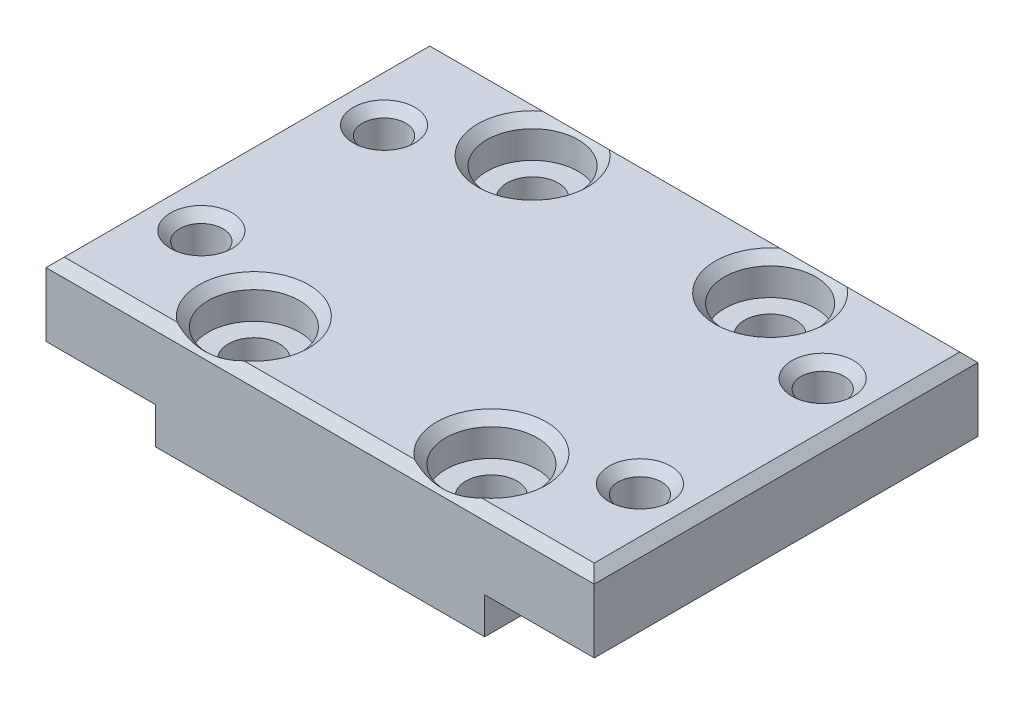
ISO-10303-21;
HEADER;
FILE_DESCRIPTION(('STEP AP214'),'2;1');
FILE_NAME('part.step','',(''),(''),'','','');
FILE_SCHEMA(('AUTOMOTIVE_DESIGN { 1 0 10303 214 1 1 1 1 }'));
ENDSEC;
DATA;
#1=APPLICATION_CONTEXT('core data for automotive mechanical design processes');
#2=APPLICATION_PROTOCOL_DEFINITION('international standard','automotive_design',2000,#1);
#3=PRODUCT_CONTEXT('',#1,'mechanical');
#4=PRODUCT('Part','Part','',(#3));
#5=PRODUCT_RELATED_PRODUCT_CATEGORY('part','',(#4));
#6=PRODUCT_DEFINITION_FORMATION('','',#4);
#7=PRODUCT_DEFINITION_CONTEXT('part definition',#1,'design');
#8=PRODUCT_DEFINITION('design','',#6,#7);
#9=PRODUCT_DEFINITION_SHAPE('','',#8);
#10=(LENGTH_UNIT() NAMED_UNIT(*) SI_UNIT(.MILLI.,.METRE.));
#11=(NAMED_UNIT(*) PLANE_ANGLE_UNIT() SI_UNIT($,.RADIAN.));
#12=(NAMED_UNIT(*) SI_UNIT($,.STERADIAN.) SOLID_ANGLE_UNIT());
#13=UNCERTAINTY_MEASURE_WITH_UNIT(LENGTH_MEASURE(1.E-05),#10,'distance_accuracy_value','');
#14=(GEOMETRIC_REPRESENTATION_CONTEXT(3) GLOBAL_UNCERTAINTY_ASSIGNED_CONTEXT((#13)) GLOBAL_UNIT_ASSIGNED_CONTEXT((#10,
#11,#12)) REPRESENTATION_CONTEXT('',''));
#15=CARTESIAN_POINT('',(0.,0.,0.));
#16=DIRECTION('',(0.,0.,1.));
#17=DIRECTION('',(1.,0.,0.));
#18=AXIS2_PLACEMENT_3D('',#15,#16,#17);
#19=CARTESIAN_POINT('',(0.,0.,0.));
#20=DIRECTION('',(0.,1.,0.));
#21=DIRECTION('',(0.,0.,1.));
#22=AXIS2_PLACEMENT_3D('',#19,#20,#21);
#23=PLANE('',#22);
#24=CARTESIAN_POINT('',(-24.,0.,10.));
#25=DIRECTION('',(0.,1.,0.));
#26=DIRECTION('',(0.,0.,1.));
#27=AXIS2_PLACEMENT_3D('',#24,#25,#26);
#28=CIRCLE('',#27,2.375);
#29=CARTESIAN_POINT('',(-24.,0.,12.375));
#30=VERTEX_POINT('',#29);
#31=EDGE_CURVE('E218',#30,#30,#28,.T.);
#32=ORIENTED_EDGE('',*,*,#31,.T.);
#33=EDGE_LOOP('',(#32));
#34=FACE_BOUND('',#33,.T.);
#35=CARTESIAN_POINT('',(-24.,0.,-10.));
#36=DIRECTION('',(0.,1.,0.));
#37=DIRECTION('',(0.,0.,1.));
#38=AXIS2_PLACEMENT_3D('',#35,#36,#37);
#39=CIRCLE('',#38,2.375);
#40=CARTESIAN_POINT('',(-24.,0.,-7.625));
#41=VERTEX_POINT('',#40);
#42=EDGE_CURVE('E221',#41,#41,#39,.T.);
#43=ORIENTED_EDGE('',*,*,#42,.T.);
#44=EDGE_LOOP('',(#43));
#45=FACE_BOUND('',#44,.T.);
#46=DIRECTION('',(0.,0.,-1.));
#47=VECTOR('',#46,1.);
#48=CARTESIAN_POINT('',(-18.,0.,0.));
#49=LINE('',#48,#47);
#50=CARTESIAN_POINT('',(-18.,0.,21.));
#51=VERTEX_POINT('',#50);
#52=CARTESIAN_POINT('',(-18.,0.,-21.));
#53=VERTEX_POINT('',#52);
#54=EDGE_CURVE('E183',#51,#53,#49,.T.);
#55=ORIENTED_EDGE('',*,*,#54,.F.);
#56=DIRECTION('',(1.,0.,0.));
#57=VECTOR('',#56,1.);
#58=CARTESIAN_POINT('',(0.,0.,21.));
#59=LINE('',#58,#57);
#60=CARTESIAN_POINT('',(-30.,0.,21.));
#61=VERTEX_POINT('',#60);
#62=EDGE_CURVE('E147',#61,#51,#59,.T.);
#63=ORIENTED_EDGE('',*,*,#62,.F.);
#64=DIRECTION('',(0.,0.,-1.));
#65=VECTOR('',#64,1.);
#66=CARTESIAN_POINT('',(-30.,0.,0.));
#67=LINE('',#66,#65);
#68=CARTESIAN_POINT('',(-30.,0.,-21.));
#69=VERTEX_POINT('',#68);
#70=EDGE_CURVE('E206',#61,#69,#67,.T.);
#71=ORIENTED_EDGE('',*,*,#70,.T.);
#72=DIRECTION('',(1.,0.,0.));
#73=VECTOR('',#72,1.);
#74=CARTESIAN_POINT('',(0.,0.,-21.));
#75=LINE('',#74,#73);
#76=EDGE_CURVE('E215',#69,#53,#75,.T.);
#77=ORIENTED_EDGE('',*,*,#76,.T.);
#78=EDGE_LOOP('',(#55,#63,#71,#77));
#79=FACE_BOUND('',#78,.T.);
#80=ADVANCED_FACE('F34',(#34,#45,#79),#23,.F.);
#81=CARTESIAN_POINT('',(13.,8.,15.25));
#82=DIRECTION('',(0.,-1.,0.));
#83=DIRECTION('',(0.,0.,-1.));
#84=AXIS2_PLACEMENT_3D('',#81,#82,#83);
#85=CYLINDRICAL_SURFACE('',#84,2.8);
#86=CARTESIAN_POINT('',(13.,4.,15.25));
#87=DIRECTION('',(0.,1.,0.));
#88=DIRECTION('',(0.,0.,1.));
#89=AXIS2_PLACEMENT_3D('',#86,#87,#88);
#90=CIRCLE('',#89,2.8);
#91=CARTESIAN_POINT('',(13.,4.,18.05));
#92=VERTEX_POINT('',#91);
#93=EDGE_CURVE('E205',#92,#92,#90,.T.);
#94=ORIENTED_EDGE('',*,*,#93,.T.);
#95=EDGE_LOOP('',(#94));
#96=FACE_BOUND('',#95,.T.);
#97=CARTESIAN_POINT('',(13.,-4.,15.25));
#98=DIRECTION('',(0.,1.,0.));
#99=DIRECTION('',(0.,0.,1.));
#100=AXIS2_PLACEMENT_3D('',#97,#98,#99);
#101=CIRCLE('',#100,2.8);
#102=CARTESIAN_POINT('',(13.,-4.,18.05));
#103=VERTEX_POINT('',#102);
#104=EDGE_CURVE('E178',#103,#103,#101,.T.);
#105=ORIENTED_EDGE('',*,*,#104,.F.);
#106=EDGE_LOOP('',(#105));
#107=FACE_BOUND('',#106,.T.);
#108=ADVANCED_FACE('F411',(#96,#107),#85,.F.);
#109=CARTESIAN_POINT('',(13.,8.,-15.25));
#110=DIRECTION('',(0.,-1.,0.));
#111=DIRECTION('',(0.,0.,-1.));
#112=AXIS2_PLACEMENT_3D('',#109,#110,#111);
#113=CYLINDRICAL_SURFACE('',#112,2.8);
#114=CARTESIAN_POINT('',(13.,4.,-15.25));
#115=DIRECTION('',(0.,1.,0.));
#116=DIRECTION('',(0.,0.,1.));
#117=AXIS2_PLACEMENT_3D('',#114,#115,#116);
#118=CIRCLE('',#117,2.8);
#119=CARTESIAN_POINT('',(13.,4.,-12.45));
#120=VERTEX_POINT('',#119);
#121=EDGE_CURVE('E243',#120,#120,#118,.T.);
#122=ORIENTED_EDGE('',*,*,#121,.T.);
#123=EDGE_LOOP('',(#122));
#124=FACE_BOUND('',#123,.T.);
#125=CARTESIAN_POINT('',(13.,-4.,-15.25));
#126=DIRECTION('',(0.,1.,0.));
#127=DIRECTION('',(0.,0.,1.));
#128=AXIS2_PLACEMENT_3D('',#125,#126,#127);
#129=CIRCLE('',#128,2.8);
#130=CARTESIAN_POINT('',(13.,-4.,-12.45));
#131=VERTEX_POINT('',#130);
#132=EDGE_CURVE('E175',#131,#131,#129,.T.);
#133=ORIENTED_EDGE('',*,*,#132,.F.);
#134=EDGE_LOOP('',(#133));
#135=FACE_BOUND('',#134,.T.);
#136=ADVANCED_FACE('F417',(#124,#135),#113,.F.);
#137=CARTESIAN_POINT('',(-13.,8.,15.25));
#138=DIRECTION('',(0.,-1.,0.));
#139=DIRECTION('',(0.,0.,-1.));
#140=AXIS2_PLACEMENT_3D('',#137,#138,#139);
#141=CYLINDRICAL_SURFACE('',#140,2.8);
#142=CARTESIAN_POINT('',(-13.,4.,15.25));
#143=DIRECTION('',(0.,1.,0.));
#144=DIRECTION('',(0.,0.,1.));
#145=AXIS2_PLACEMENT_3D('',#142,#143,#144);
#146=CIRCLE('',#145,2.8);
#147=CARTESIAN_POINT('',(-13.,4.,18.05));
#148=VERTEX_POINT('',#147);
#149=EDGE_CURVE('E195',#148,#148,#146,.T.);
#150=ORIENTED_EDGE('',*,*,#149,.T.);
#151=EDGE_LOOP('',(#150));
#152=FACE_BOUND('',#151,.T.);
#153=CARTESIAN_POINT('',(-13.,-4.,15.25));
#154=DIRECTION('',(0.,1.,0.));
#155=DIRECTION('',(0.,0.,1.));
#156=AXIS2_PLACEMENT_3D('',#153,#154,#155);
#157=CIRCLE('',#156,2.8);
#158=CARTESIAN_POINT('',(-13.,-4.,18.05));
#159=VERTEX_POINT('',#158);
#160=EDGE_CURVE('E152',#159,#159,#157,.T.);
#161=ORIENTED_EDGE('',*,*,#160,.F.);
#162=EDGE_LOOP('',(#161));
#163=FACE_BOUND('',#162,.T.);
#164=ADVANCED_FACE('F519',(#152,#163),#141,.F.);
#165=CARTESIAN_POINT('',(-13.,8.,-15.25));
#166=DIRECTION('',(0.,-1.,0.));
#167=DIRECTION('',(0.,0.,-1.));
#168=AXIS2_PLACEMENT_3D('',#165,#166,#167);
#169=CYLINDRICAL_SURFACE('',#168,2.8);
#170=CARTESIAN_POINT('',(-13.,4.,-15.25));
#171=DIRECTION('',(0.,1.,0.));
#172=DIRECTION('',(0.,0.,1.));
#173=AXIS2_PLACEMENT_3D('',#170,#171,#172);
#174=CIRCLE('',#173,2.8);
#175=CARTESIAN_POINT('',(-13.,4.,-12.45));
#176=VERTEX_POINT('',#175);
#177=EDGE_CURVE('E204',#176,#176,#174,.T.);
#178=ORIENTED_EDGE('',*,*,#177,.T.);
#179=EDGE_LOOP('',(#178));
#180=FACE_BOUND('',#179,.T.);
#181=CARTESIAN_POINT('',(-13.,-4.,-15.25));
#182=DIRECTION('',(0.,1.,0.));
#183=DIRECTION('',(0.,0.,1.));
#184=AXIS2_PLACEMENT_3D('',#181,#182,#183);
#185=CIRCLE('',#184,2.8);
#186=CARTESIAN_POINT('',(-13.,-4.,-12.45));
#187=VERTEX_POINT('',#186);
#188=EDGE_CURVE('E172',#187,#187,#185,.T.);
#189=ORIENTED_EDGE('',*,*,#188,.F.);
#190=EDGE_LOOP('',(#189));
#191=FACE_BOUND('',#190,.T.);
#192=ADVANCED_FACE('F517',(#180,#191),#169,.F.);
#193=CARTESIAN_POINT('',(-30.,8.,0.));
#194=DIRECTION('',(-1.,0.,0.));
#195=DIRECTION('',(0.,0.,1.));
#196=AXIS2_PLACEMENT_3D('',#193,#194,#195);
#197=PLANE('',#196);
#198=DIRECTION('',(0.,-1.,0.));
#199=VECTOR('',#198,1.);
#200=CARTESIAN_POINT('',(-30.,8.,21.));
#201=LINE('',#200,#199);
#202=CARTESIAN_POINT('',(-30.,7.,21.));
#203=VERTEX_POINT('',#202);
#204=EDGE_CURVE('E236',#203,#61,#201,.T.);
#205=ORIENTED_EDGE('',*,*,#204,.F.);
#206=DIRECTION('',(0.,0.,-1.));
#207=VECTOR('',#206,1.);
#208=CARTESIAN_POINT('',(-30.,7.,0.));
#209=LINE('',#208,#207);
#210=CARTESIAN_POINT('',(-30.,7.,-21.));
#211=VERTEX_POINT('',#210);
#212=EDGE_CURVE('E301',#203,#211,#209,.T.);
#213=ORIENTED_EDGE('',*,*,#212,.T.);
#214=DIRECTION('',(0.,-1.,0.));
#215=VECTOR('',#214,1.);
#216=CARTESIAN_POINT('',(-30.,8.,-21.));
#217=LINE('',#216,#215);
#218=EDGE_CURVE('E230',#211,#69,#217,.T.);
#219=ORIENTED_EDGE('',*,*,#218,.T.);
#220=ORIENTED_EDGE('',*,*,#70,.F.);
#221=EDGE_LOOP('',(#205,#213,#219,#220));
#222=FACE_BOUND('',#221,.T.);
#223=ADVANCED_FACE('F407',(#222),#197,.T.);
#224=CARTESIAN_POINT('',(0.,8.,21.));
#225=DIRECTION('',(0.,0.,-1.));
#226=DIRECTION('',(-1.,0.,0.));
#227=AXIS2_PLACEMENT_3D('',#224,#225,#226);
#228=PLANE('',#227);
#229=DIRECTION('',(0.,-1.,0.));
#230=VECTOR('',#229,1.);
#231=CARTESIAN_POINT('',(30.,8.,21.));
#232=LINE('',#231,#230);
#233=CARTESIAN_POINT('',(30.,7.,21.));
#234=VERTEX_POINT('',#233);
#235=CARTESIAN_POINT('',(30.,0.,21.));
#236=VERTEX_POINT('',#235);
#237=EDGE_CURVE('E234',#234,#236,#232,.T.);
#238=ORIENTED_EDGE('',*,*,#237,.F.);
#239=DIRECTION('',(-1.,0.,0.));
#240=VECTOR('',#239,1.);
#241=CARTESIAN_POINT('',(-30.,7.,21.));
#242=LINE('',#241,#240);
#243=EDGE_CURVE('E55',#234,#203,#242,.T.);
#244=ORIENTED_EDGE('',*,*,#243,.T.);
#245=ORIENTED_EDGE('',*,*,#204,.T.);
#246=ORIENTED_EDGE('',*,*,#62,.T.);
#247=DIRECTION('',(0.,1.,0.));
#248=VECTOR('',#247,1.);
#249=CARTESIAN_POINT('',(-18.,-4.,21.));
#250=LINE('',#249,#248);
#251=CARTESIAN_POINT('',(-18.,-4.,21.));
#252=VERTEX_POINT('',#251);
#253=EDGE_CURVE('E141',#252,#51,#250,.T.);
#254=ORIENTED_EDGE('',*,*,#253,.F.);
#255=DIRECTION('',(1.,0.,0.));
#256=VECTOR('',#255,1.);
#257=CARTESIAN_POINT('',(0.,-4.,21.));
#258=LINE('',#257,#256);
#259=CARTESIAN_POINT('',(18.,-4.,21.));
#260=VERTEX_POINT('',#259);
#261=EDGE_CURVE('E145',#252,#260,#258,.T.);
#262=ORIENTED_EDGE('',*,*,#261,.T.);
#263=DIRECTION('',(0.,1.,0.));
#264=VECTOR('',#263,1.);
#265=CARTESIAN_POINT('',(18.,-4.,21.));
#266=LINE('',#265,#264);
#267=CARTESIAN_POINT('',(18.,0.,21.));
#268=VERTEX_POINT('',#267);
#269=EDGE_CURVE('E151',#260,#268,#266,.T.);
#270=ORIENTED_EDGE('',*,*,#269,.T.);
#271=EDGE_CURVE('E209',#268,#236,#59,.T.);
#272=ORIENTED_EDGE('',*,*,#271,.T.);
#273=EDGE_LOOP('',(#238,#244,#245,#246,#254,#262,#270,#272));
#274=FACE_BOUND('',#273,.T.);
#275=ADVANCED_FACE('F143',(#274),#228,.F.);
#276=CARTESIAN_POINT('',(30.,8.,0.));
#277=DIRECTION('',(-1.,0.,0.));
#278=DIRECTION('',(0.,0.,1.));
#279=AXIS2_PLACEMENT_3D('',#276,#277,#278);
#280=PLANE('',#279);
#281=DIRECTION('',(0.,-1.,0.));
#282=VECTOR('',#281,1.);
#283=CARTESIAN_POINT('',(30.,8.,-21.));
#284=LINE('',#283,#282);
#285=CARTESIAN_POINT('',(30.,7.,-21.));
#286=VERTEX_POINT('',#285);
#287=CARTESIAN_POINT('',(30.,0.,-21.));
#288=VERTEX_POINT('',#287);
#289=EDGE_CURVE('E232',#286,#288,#284,.T.);
#290=ORIENTED_EDGE('',*,*,#289,.F.);
#291=DIRECTION('',(0.,0.,1.));
#292=VECTOR('',#291,1.);
#293=CARTESIAN_POINT('',(30.,7.,21.));
#294=LINE('',#293,#292);
#295=EDGE_CURVE('E63',#286,#234,#294,.T.);
#296=ORIENTED_EDGE('',*,*,#295,.T.);
#297=ORIENTED_EDGE('',*,*,#237,.T.);
#298=DIRECTION('',(0.,0.,-1.));
#299=VECTOR('',#298,1.);
#300=CARTESIAN_POINT('',(30.,0.,0.));
#301=LINE('',#300,#299);
#302=EDGE_CURVE('E211',#236,#288,#301,.T.);
#303=ORIENTED_EDGE('',*,*,#302,.T.);
#304=EDGE_LOOP('',(#290,#296,#297,#303));
#305=FACE_BOUND('',#304,.T.);
#306=ADVANCED_FACE('F389',(#305),#280,.F.);
#307=CARTESIAN_POINT('',(24.,8.,10.));
#308=DIRECTION('',(0.,-1.,0.));
#309=DIRECTION('',(0.,0.,-1.));
#310=AXIS2_PLACEMENT_3D('',#307,#308,#309);
#311=CYLINDRICAL_SURFACE('',#310,2.375);
#312=CARTESIAN_POINT('',(24.,6.99999999999999,10.));
#313=DIRECTION('',(0.,1.,0.));
#314=DIRECTION('',(0.,0.,1.));
#315=AXIS2_PLACEMENT_3D('',#312,#313,#314);
#316=CIRCLE('',#315,2.375);
#317=CARTESIAN_POINT('',(24.,6.99999999999999,12.375));
#318=VERTEX_POINT('',#317);
#319=EDGE_CURVE('E238',#318,#318,#316,.T.);
#320=ORIENTED_EDGE('',*,*,#319,.T.);
#321=EDGE_LOOP('',(#320));
#322=FACE_BOUND('',#321,.T.);
#323=CARTESIAN_POINT('',(24.,0.,10.));
#324=DIRECTION('',(0.,1.,0.));
#325=DIRECTION('',(0.,0.,1.));
#326=AXIS2_PLACEMENT_3D('',#323,#324,#325);
#327=CIRCLE('',#326,2.375);
#328=CARTESIAN_POINT('',(24.,0.,12.375));
#329=VERTEX_POINT('',#328);
#330=EDGE_CURVE('E227',#329,#329,#327,.T.);
#331=ORIENTED_EDGE('',*,*,#330,.F.);
#332=EDGE_LOOP('',(#331));
#333=FACE_BOUND('',#332,.T.);
#334=ADVANCED_FACE('F523',(#322,#333),#311,.F.);
#335=CARTESIAN_POINT('',(24.,8.,-10.));
#336=DIRECTION('',(0.,-1.,0.));
#337=DIRECTION('',(0.,0.,-1.));
#338=AXIS2_PLACEMENT_3D('',#335,#336,#337);
#339=CYLINDRICAL_SURFACE('',#338,2.375);
#340=CARTESIAN_POINT('',(24.,6.99999999999999,-10.));
#341=DIRECTION('',(0.,1.,0.));
#342=DIRECTION('',(0.,0.,1.));
#343=AXIS2_PLACEMENT_3D('',#340,#341,#342);
#344=CIRCLE('',#343,2.375);
#345=CARTESIAN_POINT('',(24.,6.99999999999999,-7.625));
#346=VERTEX_POINT('',#345);
#347=EDGE_CURVE('E287',#346,#346,#344,.T.);
#348=ORIENTED_EDGE('',*,*,#347,.T.);
#349=EDGE_LOOP('',(#348));
#350=FACE_BOUND('',#349,.T.);
#351=CARTESIAN_POINT('',(24.,0.,-10.));
#352=DIRECTION('',(0.,1.,0.));
#353=DIRECTION('',(0.,0.,1.));
#354=AXIS2_PLACEMENT_3D('',#351,#352,#353);
#355=CIRCLE('',#354,2.375);
#356=CARTESIAN_POINT('',(24.,0.,-7.625));
#357=VERTEX_POINT('',#356);
#358=EDGE_CURVE('E224',#357,#357,#355,.T.);
#359=ORIENTED_EDGE('',*,*,#358,.F.);
#360=EDGE_LOOP('',(#359));
#361=FACE_BOUND('',#360,.T.);
#362=ADVANCED_FACE('F512',(#350,#361),#339,.F.);
#363=CARTESIAN_POINT('',(-24.,8.,-10.));
#364=DIRECTION('',(0.,-1.,0.));
#365=DIRECTION('',(0.,0.,-1.));
#366=AXIS2_PLACEMENT_3D('',#363,#364,#365);
#367=CYLINDRICAL_SURFACE('',#366,2.375);
#368=CARTESIAN_POINT('',(-24.,6.99999999999999,-10.));
#369=DIRECTION('',(0.,1.,0.));
#370=DIRECTION('',(0.,0.,1.));
#371=AXIS2_PLACEMENT_3D('',#368,#369,#370);
#372=CIRCLE('',#371,2.375);
#373=CARTESIAN_POINT('',(-24.,6.99999999999999,-7.625));
#374=VERTEX_POINT('',#373);
#375=EDGE_CURVE('E290',#374,#374,#372,.T.);
#376=ORIENTED_EDGE('',*,*,#375,.T.);
#377=EDGE_LOOP('',(#376));
#378=FACE_BOUND('',#377,.T.);
#379=ORIENTED_EDGE('',*,*,#42,.F.);
#380=EDGE_LOOP('',(#379));
#381=FACE_BOUND('',#380,.T.);
#382=ADVANCED_FACE('F506',(#378,#381),#367,.F.);
#383=CARTESIAN_POINT('',(-24.,8.,10.));
#384=DIRECTION('',(0.,-1.,0.));
#385=DIRECTION('',(0.,0.,-1.));
#386=AXIS2_PLACEMENT_3D('',#383,#384,#385);
#387=CYLINDRICAL_SURFACE('',#386,2.375);
#388=CARTESIAN_POINT('',(-24.,6.99999999999999,10.));
#389=DIRECTION('',(0.,1.,0.));
#390=DIRECTION('',(0.,0.,1.));
#391=AXIS2_PLACEMENT_3D('',#388,#389,#390);
#392=CIRCLE('',#391,2.375);
#393=CARTESIAN_POINT('',(-24.,6.99999999999999,12.375));
#394=VERTEX_POINT('',#393);
#395=EDGE_CURVE('E293',#394,#394,#392,.T.);
#396=ORIENTED_EDGE('',*,*,#395,.T.);
#397=EDGE_LOOP('',(#396));
#398=FACE_BOUND('',#397,.T.);
#399=ORIENTED_EDGE('',*,*,#31,.F.);
#400=EDGE_LOOP('',(#399));
#401=FACE_BOUND('',#400,.T.);
#402=ADVANCED_FACE('F436',(#398,#401),#387,.F.);
#403=CARTESIAN_POINT('',(0.,8.,-21.));
#404=DIRECTION('',(0.,0.,-1.));
#405=DIRECTION('',(-1.,0.,0.));
#406=AXIS2_PLACEMENT_3D('',#403,#404,#405);
#407=PLANE('',#406);
#408=ORIENTED_EDGE('',*,*,#218,.F.);
#409=DIRECTION('',(1.,0.,0.));
#410=VECTOR('',#409,1.);
#411=CARTESIAN_POINT('',(0.,7.,-21.));
#412=LINE('',#411,#410);
#413=EDGE_CURVE('E296',#211,#286,#412,.T.);
#414=ORIENTED_EDGE('',*,*,#413,.T.);
#415=ORIENTED_EDGE('',*,*,#289,.T.);
#416=CARTESIAN_POINT('',(18.,0.,-21.));
#417=VERTEX_POINT('',#416);
#418=EDGE_CURVE('E214',#417,#288,#75,.T.);
#419=ORIENTED_EDGE('',*,*,#418,.F.);
#420=DIRECTION('',(0.,1.,0.));
#421=VECTOR('',#420,1.);
#422=CARTESIAN_POINT('',(18.,-4.,-21.));
#423=LINE('',#422,#421);
#424=CARTESIAN_POINT('',(18.,-4.,-21.));
#425=VERTEX_POINT('',#424);
#426=EDGE_CURVE('E189',#425,#417,#423,.T.);
#427=ORIENTED_EDGE('',*,*,#426,.F.);
#428=DIRECTION('',(1.,0.,0.));
#429=VECTOR('',#428,1.);
#430=CARTESIAN_POINT('',(0.,-4.,-21.));
#431=LINE('',#430,#429);
#432=CARTESIAN_POINT('',(-18.,-4.,-21.));
#433=VERTEX_POINT('',#432);
#434=EDGE_CURVE('E168',#433,#425,#431,.T.);
#435=ORIENTED_EDGE('',*,*,#434,.F.);
#436=DIRECTION('',(0.,1.,0.));
#437=VECTOR('',#436,1.);
#438=CARTESIAN_POINT('',(-18.,-4.,-21.));
#439=LINE('',#438,#437);
#440=EDGE_CURVE('E158',#433,#53,#439,.T.);
#441=ORIENTED_EDGE('',*,*,#440,.T.);
#442=ORIENTED_EDGE('',*,*,#76,.F.);
#443=EDGE_LOOP('',(#408,#414,#415,#419,#427,#435,#441,#442));
#444=FACE_BOUND('',#443,.T.);
#445=ADVANCED_FACE('F385',(#444),#407,.T.);
#446=CARTESIAN_POINT('',(0.,8.,0.));
#447=DIRECTION('',(0.,1.,0.));
#448=DIRECTION('',(0.,0.,1.));
#449=AXIS2_PLACEMENT_3D('',#446,#447,#448);
#450=PLANE('',#449);
#451=CARTESIAN_POINT('',(24.,8.,10.));
#452=DIRECTION('',(0.,1.,0.));
#453=DIRECTION('',(0.,0.,1.));
#454=AXIS2_PLACEMENT_3D('',#451,#452,#453);
#455=CIRCLE('',#454,3.375);
#456=CARTESIAN_POINT('',(24.,8.,13.375));
#457=VERTEX_POINT('',#456);
#458=EDGE_CURVE('E284',#457,#457,#455,.F.);
#459=ORIENTED_EDGE('',*,*,#458,.T.);
#460=EDGE_LOOP('',(#459));
#461=FACE_BOUND('',#460,.T.);
#462=CARTESIAN_POINT('',(24.,8.,-10.));
#463=DIRECTION('',(0.,1.,0.));
#464=DIRECTION('',(0.,0.,1.));
#465=AXIS2_PLACEMENT_3D('',#462,#463,#464);
#466=CIRCLE('',#465,3.375);
#467=CARTESIAN_POINT('',(24.,8.,-6.625));
#468=VERTEX_POINT('',#467);
#469=EDGE_CURVE('E281',#468,#468,#466,.F.);
#470=ORIENTED_EDGE('',*,*,#469,.T.);
#471=EDGE_LOOP('',(#470));
#472=FACE_BOUND('',#471,.T.);
#473=CARTESIAN_POINT('',(-24.,8.,-10.));
#474=DIRECTION('',(0.,1.,0.));
#475=DIRECTION('',(0.,0.,1.));
#476=AXIS2_PLACEMENT_3D('',#473,#474,#475);
#477=CIRCLE('',#476,3.375);
#478=CARTESIAN_POINT('',(-24.,8.,-6.625));
#479=VERTEX_POINT('',#478);
#480=EDGE_CURVE('E278',#479,#479,#477,.F.);
#481=ORIENTED_EDGE('',*,*,#480,.T.);
#482=EDGE_LOOP('',(#481));
#483=FACE_BOUND('',#482,.T.);
#484=CARTESIAN_POINT('',(-24.,8.,10.));
#485=DIRECTION('',(0.,1.,0.));
#486=DIRECTION('',(0.,0.,1.));
#487=AXIS2_PLACEMENT_3D('',#484,#485,#486);
#488=CIRCLE('',#487,3.375);
#489=CARTESIAN_POINT('',(-24.,8.,13.375));
#490=VERTEX_POINT('',#489);
#491=EDGE_CURVE('E275',#490,#490,#488,.F.);
#492=ORIENTED_EDGE('',*,*,#491,.T.);
#493=EDGE_LOOP('',(#492));
#494=FACE_BOUND('',#493,.T.);
#495=CARTESIAN_POINT('',(-13.,8.,15.25));
#496=DIRECTION('',(0.,1.,0.));
#497=DIRECTION('',(0.,0.,1.));
#498=AXIS2_PLACEMENT_3D('',#495,#496,#497);
#499=CIRCLE('',#498,6.00000000000002);
#500=CARTESIAN_POINT('',(-16.6657195746538,8.,20.));
#501=VERTEX_POINT('',#500);
#502=CARTESIAN_POINT('',(-9.33428042534617,8.,20.));
#503=VERTEX_POINT('',#502);
#504=EDGE_CURVE('E269',#501,#503,#499,.F.);
#505=ORIENTED_EDGE('',*,*,#504,.T.);
#506=DIRECTION('',(1.,0.,0.));
#507=VECTOR('',#506,1.);
#508=CARTESIAN_POINT('',(30.,8.,20.));
#509=LINE('',#508,#507);
#510=CARTESIAN_POINT('',(9.33428042534616,8.,20.));
#511=VERTEX_POINT('',#510);
#512=EDGE_CURVE('E273',#503,#511,#509,.T.);
#513=ORIENTED_EDGE('',*,*,#512,.T.);
#514=CARTESIAN_POINT('',(13.,8.,15.25));
#515=DIRECTION('',(0.,1.,0.));
#516=DIRECTION('',(0.,0.,1.));
#517=AXIS2_PLACEMENT_3D('',#514,#515,#516);
#518=CIRCLE('',#517,6.00000000000002);
#519=CARTESIAN_POINT('',(16.6657195746538,8.,20.));
#520=VERTEX_POINT('',#519);
#521=EDGE_CURVE('E271',#511,#520,#518,.F.);
#522=ORIENTED_EDGE('',*,*,#521,.T.);
#523=DIRECTION('',(1.,0.,0.));
#524=VECTOR('',#523,1.);
#525=CARTESIAN_POINT('',(30.,8.,20.));
#526=LINE('',#525,#524);
#527=CARTESIAN_POINT('',(29.,8.,20.));
#528=VERTEX_POINT('',#527);
#529=EDGE_CURVE('E265',#520,#528,#526,.T.);
#530=ORIENTED_EDGE('',*,*,#529,.T.);
#531=DIRECTION('',(0.,0.,-1.));
#532=VECTOR('',#531,1.);
#533=CARTESIAN_POINT('',(29.,8.,-21.));
#534=LINE('',#533,#532);
#535=CARTESIAN_POINT('',(29.,8.,-20.));
#536=VERTEX_POINT('',#535);
#537=EDGE_CURVE('E259',#528,#536,#534,.T.);
#538=ORIENTED_EDGE('',*,*,#537,.T.);
#539=DIRECTION('',(-1.,0.,0.));
#540=VECTOR('',#539,1.);
#541=CARTESIAN_POINT('',(0.,8.,-20.));
#542=LINE('',#541,#540);
#543=CARTESIAN_POINT('',(16.6657195746538,8.,-20.));
#544=VERTEX_POINT('',#543);
#545=EDGE_CURVE('E254',#536,#544,#542,.T.);
#546=ORIENTED_EDGE('',*,*,#545,.T.);
#547=CARTESIAN_POINT('',(13.,8.,-15.25));
#548=DIRECTION('',(0.,1.,0.));
#549=DIRECTION('',(0.,0.,1.));
#550=AXIS2_PLACEMENT_3D('',#547,#548,#549);
#551=CIRCLE('',#550,6.00000000000001);
#552=CARTESIAN_POINT('',(9.33428042534618,8.,-20.));
#553=VERTEX_POINT('',#552);
#554=EDGE_CURVE('E250',#544,#553,#551,.F.);
#555=ORIENTED_EDGE('',*,*,#554,.T.);
#556=DIRECTION('',(-1.,0.,0.));
#557=VECTOR('',#556,1.);
#558=CARTESIAN_POINT('',(0.,8.,-20.));
#559=LINE('',#558,#557);
#560=CARTESIAN_POINT('',(-9.33428042534618,8.,-20.));
#561=VERTEX_POINT('',#560);
#562=EDGE_CURVE('E252',#553,#561,#559,.T.);
#563=ORIENTED_EDGE('',*,*,#562,.T.);
#564=CARTESIAN_POINT('',(-13.,8.,-15.25));
#565=DIRECTION('',(0.,1.,0.));
#566=DIRECTION('',(0.,0.,1.));
#567=AXIS2_PLACEMENT_3D('',#564,#565,#566);
#568=CIRCLE('',#567,6.00000000000001);
#569=CARTESIAN_POINT('',(-16.6657195746538,8.,-20.));
#570=VERTEX_POINT('',#569);
#571=EDGE_CURVE('E257',#561,#570,#568,.F.);
#572=ORIENTED_EDGE('',*,*,#571,.T.);
#573=DIRECTION('',(-1.,0.,0.));
#574=VECTOR('',#573,1.);
#575=CARTESIAN_POINT('',(0.,8.,-20.));
#576=LINE('',#575,#574);
#577=CARTESIAN_POINT('',(-29.,8.,-20.));
#578=VERTEX_POINT('',#577);
#579=EDGE_CURVE('E261',#570,#578,#576,.T.);
#580=ORIENTED_EDGE('',*,*,#579,.T.);
#581=DIRECTION('',(0.,0.,1.));
#582=VECTOR('',#581,1.);
#583=CARTESIAN_POINT('',(-29.,8.,0.));
#584=LINE('',#583,#582);
#585=CARTESIAN_POINT('',(-29.,8.,20.));
#586=VERTEX_POINT('',#585);
#587=EDGE_CURVE('E263',#578,#586,#584,.T.);
#588=ORIENTED_EDGE('',*,*,#587,.T.);
#589=DIRECTION('',(1.,0.,0.));
#590=VECTOR('',#589,1.);
#591=CARTESIAN_POINT('',(30.,8.,20.));
#592=LINE('',#591,#590);
#593=EDGE_CURVE('E267',#586,#501,#592,.T.);
#594=ORIENTED_EDGE('',*,*,#593,.T.);
#595=EDGE_LOOP('',(#505,#513,#522,#530,#538,#546,#555,#563,#572,#580,#588,#594));
#596=FACE_BOUND('',#595,.T.);
#597=ADVANCED_FACE('F378',(#461,#472,#483,#494,#596),#450,.T.);
#598=ORIENTED_EDGE('',*,*,#271,.F.);
#599=DIRECTION('',(0.,0.,-1.));
#600=VECTOR('',#599,1.);
#601=CARTESIAN_POINT('',(18.,0.,0.));
#602=LINE('',#601,#600);
#603=EDGE_CURVE('E160',#268,#417,#602,.T.);
#604=ORIENTED_EDGE('',*,*,#603,.T.);
#605=ORIENTED_EDGE('',*,*,#418,.T.);
#606=ORIENTED_EDGE('',*,*,#302,.F.);
#607=EDGE_LOOP('',(#598,#604,#605,#606));
#608=FACE_BOUND('',#607,.T.);
#609=ORIENTED_EDGE('',*,*,#358,.T.);
#610=EDGE_LOOP('',(#609));
#611=FACE_BOUND('',#610,.T.);
#612=ORIENTED_EDGE('',*,*,#330,.T.);
#613=EDGE_LOOP('',(#612));
#614=FACE_BOUND('',#613,.T.);
#615=ADVANCED_FACE('F394',(#608,#611,#614),#23,.F.);
#616=CARTESIAN_POINT('',(-13.,4.,-15.25));
#617=DIRECTION('',(0.,1.,0.));
#618=DIRECTION('',(0.,0.,1.));
#619=AXIS2_PLACEMENT_3D('',#616,#617,#618);
#620=CYLINDRICAL_SURFACE('',#619,5.);
#621=CARTESIAN_POINT('',(-13.,6.99999999999998,-15.25));
#622=DIRECTION('',(0.,1.,0.));
#623=DIRECTION('',(0.,0.,1.));
#624=AXIS2_PLACEMENT_3D('',#621,#622,#623);
#625=CIRCLE('',#624,5.);
#626=CARTESIAN_POINT('',(-13.,6.99999999999998,-10.25));
#627=VERTEX_POINT('',#626);
#628=EDGE_CURVE('E303',#627,#627,#625,.T.);
#629=ORIENTED_EDGE('',*,*,#628,.T.);
#630=EDGE_LOOP('',(#629));
#631=FACE_BOUND('',#630,.T.);
#632=CARTESIAN_POINT('',(-13.,4.,-15.25));
#633=DIRECTION('',(0.,1.,0.));
#634=DIRECTION('',(0.,0.,1.));
#635=AXIS2_PLACEMENT_3D('',#632,#633,#634);
#636=CIRCLE('',#635,5.);
#637=CARTESIAN_POINT('',(-13.,4.,-10.25));
#638=VERTEX_POINT('',#637);
#639=EDGE_CURVE('E201',#638,#638,#636,.T.);
#640=ORIENTED_EDGE('',*,*,#639,.F.);
#641=EDGE_LOOP('',(#640));
#642=FACE_BOUND('',#641,.T.);
#643=ADVANCED_FACE('F424',(#631,#642),#620,.F.);
#644=CARTESIAN_POINT('',(-13.,4.,-15.25));
#645=DIRECTION('',(0.,1.,0.));
#646=DIRECTION('',(0.,0.,1.));
#647=AXIS2_PLACEMENT_3D('',#644,#645,#646);
#648=PLANE('',#647);
#649=ORIENTED_EDGE('',*,*,#177,.F.);
#650=EDGE_LOOP('',(#649));
#651=FACE_BOUND('',#650,.T.);
#652=ORIENTED_EDGE('',*,*,#639,.T.);
#653=EDGE_LOOP('',(#652));
#654=FACE_BOUND('',#653,.T.);
#655=ADVANCED_FACE('F429',(#651,#654),#648,.T.);
#656=CARTESIAN_POINT('',(13.,4.,15.25));
#657=DIRECTION('',(0.,1.,0.));
#658=DIRECTION('',(0.,0.,1.));
#659=AXIS2_PLACEMENT_3D('',#656,#657,#658);
#660=CYLINDRICAL_SURFACE('',#659,5.);
#661=CARTESIAN_POINT('',(13.,6.99999999999999,15.25));
#662=DIRECTION('',(0.,1.,0.));
#663=DIRECTION('',(0.,0.,1.));
#664=AXIS2_PLACEMENT_3D('',#661,#662,#663);
#665=CIRCLE('',#664,5.);
#666=CARTESIAN_POINT('',(13.,6.99999999999999,20.25));
#667=VERTEX_POINT('',#666);
#668=EDGE_CURVE('E306',#667,#667,#665,.T.);
#669=ORIENTED_EDGE('',*,*,#668,.T.);
#670=EDGE_LOOP('',(#669));
#671=FACE_BOUND('',#670,.T.);
#672=CARTESIAN_POINT('',(13.,4.,15.25));
#673=DIRECTION('',(0.,1.,0.));
#674=DIRECTION('',(0.,0.,1.));
#675=AXIS2_PLACEMENT_3D('',#672,#673,#674);
#676=CIRCLE('',#675,5.);
#677=CARTESIAN_POINT('',(13.,4.,20.25));
#678=VERTEX_POINT('',#677);
#679=EDGE_CURVE('E188',#678,#678,#676,.T.);
#680=ORIENTED_EDGE('',*,*,#679,.F.);
#681=EDGE_LOOP('',(#680));
#682=FACE_BOUND('',#681,.T.);
#683=ADVANCED_FACE('F442',(#671,#682),#660,.F.);
#684=CARTESIAN_POINT('',(13.,4.,15.25));
#685=DIRECTION('',(0.,1.,0.));
#686=DIRECTION('',(0.,0.,1.));
#687=AXIS2_PLACEMENT_3D('',#684,#685,#686);
#688=PLANE('',#687);
#689=ORIENTED_EDGE('',*,*,#93,.F.);
#690=EDGE_LOOP('',(#689));
#691=FACE_BOUND('',#690,.T.);
#692=ORIENTED_EDGE('',*,*,#679,.T.);
#693=EDGE_LOOP('',(#692));
#694=FACE_BOUND('',#693,.T.);
#695=ADVANCED_FACE('F444',(#691,#694),#688,.T.);
#696=CARTESIAN_POINT('',(-13.,4.,15.25));
#697=DIRECTION('',(0.,1.,0.));
#698=DIRECTION('',(0.,0.,1.));
#699=AXIS2_PLACEMENT_3D('',#696,#697,#698);
#700=CYLINDRICAL_SURFACE('',#699,5.);
#701=CARTESIAN_POINT('',(-13.,6.99999999999999,15.25));
#702=DIRECTION('',(0.,1.,0.));
#703=DIRECTION('',(0.,0.,1.));
#704=AXIS2_PLACEMENT_3D('',#701,#702,#703);
#705=CIRCLE('',#704,5.);
#706=CARTESIAN_POINT('',(-13.,6.99999999999999,20.25));
#707=VERTEX_POINT('',#706);
#708=EDGE_CURVE('E47',#707,#707,#705,.T.);
#709=ORIENTED_EDGE('',*,*,#708,.T.);
#710=EDGE_LOOP('',(#709));
#711=FACE_BOUND('',#710,.T.);
#712=CARTESIAN_POINT('',(-13.,4.,15.25));
#713=DIRECTION('',(0.,1.,0.));
#714=DIRECTION('',(0.,0.,1.));
#715=AXIS2_PLACEMENT_3D('',#712,#713,#714);
#716=CIRCLE('',#715,5.);
#717=CARTESIAN_POINT('',(-13.,4.,20.25));
#718=VERTEX_POINT('',#717);
#719=EDGE_CURVE('E196',#718,#718,#716,.T.);
#720=ORIENTED_EDGE('',*,*,#719,.F.);
#721=EDGE_LOOP('',(#720));
#722=FACE_BOUND('',#721,.T.);
#723=ADVANCED_FACE('F447',(#711,#722),#700,.F.);
#724=CARTESIAN_POINT('',(-13.,4.,15.25));
#725=DIRECTION('',(0.,1.,0.));
#726=DIRECTION('',(0.,0.,1.));
#727=AXIS2_PLACEMENT_3D('',#724,#725,#726);
#728=PLANE('',#727);
#729=ORIENTED_EDGE('',*,*,#149,.F.);
#730=EDGE_LOOP('',(#729));
#731=FACE_BOUND('',#730,.T.);
#732=ORIENTED_EDGE('',*,*,#719,.T.);
#733=EDGE_LOOP('',(#732));
#734=FACE_BOUND('',#733,.T.);
#735=ADVANCED_FACE('F452',(#731,#734),#728,.T.);
#736=CARTESIAN_POINT('',(13.,4.,-15.25));
#737=DIRECTION('',(0.,1.,0.));
#738=DIRECTION('',(0.,0.,1.));
#739=AXIS2_PLACEMENT_3D('',#736,#737,#738);
#740=CYLINDRICAL_SURFACE('',#739,5.);
#741=CARTESIAN_POINT('',(13.,6.99999999999998,-15.25));
#742=DIRECTION('',(0.,1.,0.));
#743=DIRECTION('',(0.,0.,1.));
#744=AXIS2_PLACEMENT_3D('',#741,#742,#743);
#745=CIRCLE('',#744,5.);
#746=CARTESIAN_POINT('',(13.,6.99999999999998,-10.25));
#747=VERTEX_POINT('',#746);
#748=EDGE_CURVE('E11',#747,#747,#745,.T.);
#749=ORIENTED_EDGE('',*,*,#748,.T.);
#750=EDGE_LOOP('',(#749));
#751=FACE_BOUND('',#750,.T.);
#752=CARTESIAN_POINT('',(13.,4.,-15.25));
#753=DIRECTION('',(0.,1.,0.));
#754=DIRECTION('',(0.,0.,1.));
#755=AXIS2_PLACEMENT_3D('',#752,#753,#754);
#756=CIRCLE('',#755,5.);
#757=CARTESIAN_POINT('',(13.,4.,-10.25));
#758=VERTEX_POINT('',#757);
#759=EDGE_CURVE('E192',#758,#758,#756,.T.);
#760=ORIENTED_EDGE('',*,*,#759,.F.);
#761=EDGE_LOOP('',(#760));
#762=FACE_BOUND('',#761,.T.);
#763=ADVANCED_FACE('F455',(#751,#762),#740,.F.);
#764=CARTESIAN_POINT('',(13.,4.,-15.25));
#765=DIRECTION('',(0.,1.,0.));
#766=DIRECTION('',(0.,0.,1.));
#767=AXIS2_PLACEMENT_3D('',#764,#765,#766);
#768=PLANE('',#767);
#769=ORIENTED_EDGE('',*,*,#121,.F.);
#770=EDGE_LOOP('',(#769));
#771=FACE_BOUND('',#770,.T.);
#772=ORIENTED_EDGE('',*,*,#759,.T.);
#773=EDGE_LOOP('',(#772));
#774=FACE_BOUND('',#773,.T.);
#775=ADVANCED_FACE('F460',(#771,#774),#768,.T.);
#776=CARTESIAN_POINT('',(-18.,-4.,0.));
#777=DIRECTION('',(1.,0.,0.));
#778=DIRECTION('',(0.,0.,-1.));
#779=AXIS2_PLACEMENT_3D('',#776,#777,#778);
#780=PLANE('',#779);
#781=ORIENTED_EDGE('',*,*,#54,.T.);
#782=ORIENTED_EDGE('',*,*,#440,.F.);
#783=DIRECTION('',(0.,0.,-1.));
#784=VECTOR('',#783,1.);
#785=CARTESIAN_POINT('',(-18.,-4.,0.));
#786=LINE('',#785,#784);
#787=EDGE_CURVE('E156',#252,#433,#786,.T.);
#788=ORIENTED_EDGE('',*,*,#787,.F.);
#789=ORIENTED_EDGE('',*,*,#253,.T.);
#790=EDGE_LOOP('',(#781,#782,#788,#789));
#791=FACE_BOUND('',#790,.T.);
#792=ADVANCED_FACE('F157',(#791),#780,.F.);
#793=CARTESIAN_POINT('',(18.,-4.,0.));
#794=DIRECTION('',(1.,0.,0.));
#795=DIRECTION('',(0.,0.,-1.));
#796=AXIS2_PLACEMENT_3D('',#793,#794,#795);
#797=PLANE('',#796);
#798=ORIENTED_EDGE('',*,*,#603,.F.);
#799=ORIENTED_EDGE('',*,*,#269,.F.);
#800=DIRECTION('',(0.,0.,-1.));
#801=VECTOR('',#800,1.);
#802=CARTESIAN_POINT('',(18.,-4.,0.));
#803=LINE('',#802,#801);
#804=EDGE_CURVE('E166',#260,#425,#803,.T.);
#805=ORIENTED_EDGE('',*,*,#804,.T.);
#806=ORIENTED_EDGE('',*,*,#426,.T.);
#807=EDGE_LOOP('',(#798,#799,#805,#806));
#808=FACE_BOUND('',#807,.T.);
#809=ADVANCED_FACE('F399',(#808),#797,.T.);
#810=CARTESIAN_POINT('',(0.,-4.,0.));
#811=DIRECTION('',(0.,1.,0.));
#812=DIRECTION('',(0.,0.,1.));
#813=AXIS2_PLACEMENT_3D('',#810,#811,#812);
#814=PLANE('',#813);
#815=ORIENTED_EDGE('',*,*,#787,.T.);
#816=ORIENTED_EDGE('',*,*,#434,.T.);
#817=ORIENTED_EDGE('',*,*,#804,.F.);
#818=ORIENTED_EDGE('',*,*,#261,.F.);
#819=EDGE_LOOP('',(#815,#816,#817,#818));
#820=FACE_BOUND('',#819,.T.);
#821=ORIENTED_EDGE('',*,*,#188,.T.);
#822=EDGE_LOOP('',(#821));
#823=FACE_BOUND('',#822,.T.);
#824=ORIENTED_EDGE('',*,*,#132,.T.);
#825=EDGE_LOOP('',(#824));
#826=FACE_BOUND('',#825,.T.);
#827=ORIENTED_EDGE('',*,*,#104,.T.);
#828=EDGE_LOOP('',(#827));
#829=FACE_BOUND('',#828,.T.);
#830=ORIENTED_EDGE('',*,*,#160,.T.);
#831=EDGE_LOOP('',(#830));
#832=FACE_BOUND('',#831,.T.);
#833=ADVANCED_FACE('F163',(#820,#823,#826,#829,#832),#814,.F.);
#834=CARTESIAN_POINT('',(24.,6.99999999999999,10.));
#835=DIRECTION('',(0.,1.,0.));
#836=DIRECTION('',(0.,0.,1.));
#837=AXIS2_PLACEMENT_3D('',#834,#835,#836);
#838=CONICAL_SURFACE('',#837,2.375,0.785398163397448);
#839=ORIENTED_EDGE('',*,*,#458,.F.);
#840=EDGE_LOOP('',(#839));
#841=FACE_BOUND('',#840,.T.);
#842=ORIENTED_EDGE('',*,*,#319,.F.);
#843=EDGE_LOOP('',(#842));
#844=FACE_BOUND('',#843,.T.);
#845=ADVANCED_FACE('F472',(#841,#844),#838,.F.);
#846=CARTESIAN_POINT('',(24.,6.99999999999999,-10.));
#847=DIRECTION('',(0.,1.,0.));
#848=DIRECTION('',(0.,0.,1.));
#849=AXIS2_PLACEMENT_3D('',#846,#847,#848);
#850=CONICAL_SURFACE('',#849,2.375,0.785398163397448);
#851=ORIENTED_EDGE('',*,*,#469,.F.);
#852=EDGE_LOOP('',(#851));
#853=FACE_BOUND('',#852,.T.);
#854=ORIENTED_EDGE('',*,*,#347,.F.);
#855=EDGE_LOOP('',(#854));
#856=FACE_BOUND('',#855,.T.);
#857=ADVANCED_FACE('F476',(#853,#856),#850,.F.);
#858=CARTESIAN_POINT('',(-24.,6.99999999999999,-10.));
#859=DIRECTION('',(0.,1.,0.));
#860=DIRECTION('',(0.,0.,1.));
#861=AXIS2_PLACEMENT_3D('',#858,#859,#860);
#862=CONICAL_SURFACE('',#861,2.375,0.785398163397448);
#863=ORIENTED_EDGE('',*,*,#480,.F.);
#864=EDGE_LOOP('',(#863));
#865=FACE_BOUND('',#864,.T.);
#866=ORIENTED_EDGE('',*,*,#375,.F.);
#867=EDGE_LOOP('',(#866));
#868=FACE_BOUND('',#867,.T.);
#869=ADVANCED_FACE('F482',(#865,#868),#862,.F.);
#870=CARTESIAN_POINT('',(-24.,6.99999999999999,10.));
#871=DIRECTION('',(0.,1.,0.));
#872=DIRECTION('',(0.,0.,1.));
#873=AXIS2_PLACEMENT_3D('',#870,#871,#872);
#874=CONICAL_SURFACE('',#873,2.375,0.785398163397448);
#875=ORIENTED_EDGE('',*,*,#491,.F.);
#876=EDGE_LOOP('',(#875));
#877=FACE_BOUND('',#876,.T.);
#878=ORIENTED_EDGE('',*,*,#395,.F.);
#879=EDGE_LOOP('',(#878));
#880=FACE_BOUND('',#879,.T.);
#881=ADVANCED_FACE('F491',(#877,#880),#874,.F.);
#882=CARTESIAN_POINT('',(-13.,6.99999999999999,15.25));
#883=DIRECTION('',(0.,1.,0.));
#884=DIRECTION('',(0.,0.,1.));
#885=AXIS2_PLACEMENT_3D('',#882,#883,#884);
#886=CONICAL_SURFACE('',#885,5.,0.785398163397453);
#887=ORIENTED_EDGE('',*,*,#708,.F.);
#888=EDGE_LOOP('',(#887));
#889=FACE_BOUND('',#888,.T.);
#890=CARTESIAN_POINT('',(-9.33369395712793,8.0002,19.9998));
#891=CARTESIAN_POINT('',(-9.45147356376721,7.96003168473067,20.0399683152693));
#892=CARTESIAN_POINT('',(-9.57031728486584,7.92143544145113,20.0785645585489));
#893=CARTESIAN_POINT('',(-9.8101067802814,7.84760608301218,20.1523939169878));
#894=CARTESIAN_POINT('',(-9.93105303560326,7.81237374972203,20.187626250278));
#895=CARTESIAN_POINT('',(-10.2972636351841,7.71198496705729,20.2880150329427));
#896=CARTESIAN_POINT('',(-10.5455710718545,7.65225003704496,20.347749962955));
#897=CARTESIAN_POINT('',(-11.0477240914628,7.54935568471503,20.450644315285));
#898=CARTESIAN_POINT('',(-11.3015381845626,7.5061197270238,20.4938802729762));
#899=CARTESIAN_POINT('',(-11.8138047958949,7.43739762229311,20.5626023777069));
#900=CARTESIAN_POINT('',(-12.0722539362104,7.41189904801617,20.5881009519838));
#901=CARTESIAN_POINT('',(-12.5762862057865,7.38057106207543,20.6194289379246));
#902=CARTESIAN_POINT('',(-12.8217371592174,7.37367792133262,20.6263220786674));
#903=CARTESIAN_POINT('',(-13.3124812002276,7.37674102211898,20.623258977881));
#904=CARTESIAN_POINT('',(-13.5577742457234,7.38670067924169,20.6132993207583));
#905=CARTESIAN_POINT('',(-14.0457454984813,7.42309642697884,20.5769035730212));
#906=CARTESIAN_POINT('',(-14.2884250625866,7.44952350256164,20.5504764974384));
#907=CARTESIAN_POINT('',(-14.769252074531,7.51790415993031,20.4820958400697));
#908=CARTESIAN_POINT('',(-15.0074007347255,7.5598535251194,20.4401464748806));
#909=CARTESIAN_POINT('',(-15.4873394408952,7.65997431845349,20.3400256815465));
#910=CARTESIAN_POINT('',(-15.7288822219552,7.71873729089306,20.2812627091069));
#911=CARTESIAN_POINT('',(-16.0851564618538,7.81705130939479,20.1829486906052));
#912=CARTESIAN_POINT('',(-16.202783942654,7.85147487718384,20.1485251228162));
#913=CARTESIAN_POINT('',(-16.436045161349,7.92350307321822,20.0764969267818));
#914=CARTESIAN_POINT('',(-16.5516793379906,7.9611069903892,20.0388930096108));
#915=CARTESIAN_POINT('',(-16.6663060428721,8.0002,19.9998));
#916=B_SPLINE_CURVE_WITH_KNOTS('',3,(#890,#891,#892,#893,#894,#895,#896,#897,#898,#899,#900,
#901,#902,#903,#904,#905,#906,#907,#908,#909,#910,#911,#912,#913,#914,#915),.UNSPECIFIED.,.F.,
.F.,(4,2,2,2,2,2,2,2,2,2,2,2,4),(0.,0.392245612536374,0.78458217340296,1.57034914143781,
2.35242545649597,3.13395327669107,3.86974553352456,4.60568693285191,5.34122579711858,
6.07656500033568,6.84187816561147,7.22370985567762,7.60545639894827),.UNSPECIFIED.);
#917=EDGE_CURVE('E38',#503,#501,#916,.T.);
#918=ORIENTED_EDGE('',*,*,#917,.F.);
#919=ORIENTED_EDGE('',*,*,#504,.F.);
#920=EDGE_LOOP('',(#918,#919));
#921=FACE_BOUND('',#920,.T.);
#922=ADVANCED_FACE('F494',(#889,#921),#886,.F.);
#923=CARTESIAN_POINT('',(13.,6.99999999999999,15.25));
#924=DIRECTION('',(0.,1.,0.));
#925=DIRECTION('',(0.,0.,1.));
#926=AXIS2_PLACEMENT_3D('',#923,#924,#925);
#927=CONICAL_SURFACE('',#926,5.,0.785398163397453);
#928=ORIENTED_EDGE('',*,*,#668,.F.);
#929=EDGE_LOOP('',(#928));
#930=FACE_BOUND('',#929,.T.);
#931=CARTESIAN_POINT('',(16.6663060428721,8.0002,19.9998));
#932=CARTESIAN_POINT('',(16.5485264362328,7.96003168473067,20.0399683152693));
#933=CARTESIAN_POINT('',(16.4296827151342,7.92143544145113,20.0785645585489));
#934=CARTESIAN_POINT('',(16.1898932197186,7.84760608301218,20.1523939169878));
#935=CARTESIAN_POINT('',(16.0689469643967,7.81237374972203,20.187626250278));
#936=CARTESIAN_POINT('',(15.7027363648159,7.71198496705729,20.2880150329427));
#937=CARTESIAN_POINT('',(15.4544289281455,7.65225003704496,20.347749962955));
#938=CARTESIAN_POINT('',(14.9522759085372,7.54935568471503,20.450644315285));
#939=CARTESIAN_POINT('',(14.6984618154374,7.5061197270238,20.4938802729762));
#940=CARTESIAN_POINT('',(14.1861952041051,7.43739762229311,20.5626023777069));
#941=CARTESIAN_POINT('',(13.9277460637896,7.41189904801617,20.5881009519838));
#942=CARTESIAN_POINT('',(13.4237137942135,7.38057106207543,20.6194289379246));
#943=CARTESIAN_POINT('',(13.1782628407826,7.37367792133262,20.6263220786674));
#944=CARTESIAN_POINT('',(12.6875187997724,7.37674102211898,20.623258977881));
#945=CARTESIAN_POINT('',(12.4422257542766,7.38670067924169,20.6132993207583));
#946=CARTESIAN_POINT('',(11.9542545015187,7.42309642697884,20.5769035730212));
#947=CARTESIAN_POINT('',(11.7115749374134,7.44952350256164,20.5504764974384));
#948=CARTESIAN_POINT('',(11.230747925469,7.51790415993031,20.4820958400697));
#949=CARTESIAN_POINT('',(10.9925992652745,7.5598535251194,20.4401464748806));
#950=CARTESIAN_POINT('',(10.5126605591048,7.65997431845349,20.3400256815465));
#951=CARTESIAN_POINT('',(10.2711177780447,7.71873729089306,20.2812627091069));
#952=CARTESIAN_POINT('',(9.91484353814616,7.81705130939479,20.1829486906052));
#953=CARTESIAN_POINT('',(9.79721605734604,7.85147487718384,20.1485251228162));
#954=CARTESIAN_POINT('',(9.563954838651,7.92350307321822,20.0764969267818));
#955=CARTESIAN_POINT('',(9.44832066200941,7.9611069903892,20.0388930096108));
#956=CARTESIAN_POINT('',(9.33369395712792,8.0002,19.9998));
#957=B_SPLINE_CURVE_WITH_KNOTS('',3,(#931,#932,#933,#934,#935,#936,#937,#938,#939,#940,#941,
#942,#943,#944,#945,#946,#947,#948,#949,#950,#951,#952,#953,#954,#955,#956),.UNSPECIFIED.,.F.,
.F.,(4,2,2,2,2,2,2,2,2,2,2,2,4),(0.,0.392245612536374,0.784582173402958,1.57034914143781,
2.35242545649598,3.13395327669107,3.86974553352456,4.60568693285191,5.34122579711859,
6.07656500033568,6.84187816561147,7.22370985567762,7.60545639894827),.UNSPECIFIED.);
#958=EDGE_CURVE('E359',#520,#511,#957,.T.);
#959=ORIENTED_EDGE('',*,*,#958,.F.);
#960=ORIENTED_EDGE('',*,*,#521,.F.);
#961=EDGE_LOOP('',(#959,#960));
#962=FACE_BOUND('',#961,.T.);
#963=ADVANCED_FACE('F357',(#930,#962),#927,.F.);
#964=CARTESIAN_POINT('',(0.,8.,20.));
#965=DIRECTION('',(0.,0.70710678118655,0.707106781186545));
#966=DIRECTION('',(-1.,0.,0.));
#967=AXIS2_PLACEMENT_3D('',#964,#965,#966);
#968=PLANE('',#967);
#969=ORIENTED_EDGE('',*,*,#917,.T.);
#970=ORIENTED_EDGE('',*,*,#593,.F.);
#971=DIRECTION('',(-0.577350269189627,-0.577350269189623,0.577350269189627));
#972=VECTOR('',#971,1.);
#973=CARTESIAN_POINT('',(-23.,14.,14.));
#974=LINE('',#973,#972);
#975=EDGE_CURVE('E365',#203,#586,#974,.F.);
#976=ORIENTED_EDGE('',*,*,#975,.F.);
#977=ORIENTED_EDGE('',*,*,#243,.F.);
#978=DIRECTION('',(-0.577350269189627,0.577350269189623,-0.577350269189627));
#979=VECTOR('',#978,1.);
#980=CARTESIAN_POINT('',(19.3333333333333,17.6666666666666,10.3333333333333));
#981=LINE('',#980,#979);
#982=EDGE_CURVE('E367',#528,#234,#981,.F.);
#983=ORIENTED_EDGE('',*,*,#982,.F.);
#984=ORIENTED_EDGE('',*,*,#529,.F.);
#985=ORIENTED_EDGE('',*,*,#958,.T.);
#986=ORIENTED_EDGE('',*,*,#512,.F.);
#987=EDGE_LOOP('',(#969,#970,#976,#977,#983,#984,#985,#986));
#988=FACE_BOUND('',#987,.T.);
#989=ADVANCED_FACE('F36',(#988),#968,.T.);
#990=CARTESIAN_POINT('',(13.,6.99999999999998,-15.25));
#991=DIRECTION('',(0.,1.,0.));
#992=DIRECTION('',(0.,0.,1.));
#993=AXIS2_PLACEMENT_3D('',#990,#991,#992);
#994=CONICAL_SURFACE('',#993,5.,0.785398163397444);
#995=ORIENTED_EDGE('',*,*,#748,.F.);
#996=EDGE_LOOP('',(#995));
#997=FACE_BOUND('',#996,.T.);
#998=CARTESIAN_POINT('',(9.33369395712794,8.0002,-19.9998));
#999=CARTESIAN_POINT('',(9.45147356376722,7.96003168473066,-20.0399683152693));
#1000=CARTESIAN_POINT('',(9.57031728486585,7.92143544145113,-20.0785645585489));
#1001=CARTESIAN_POINT('',(9.81010678028141,7.84760608301218,-20.1523939169878));
#1002=CARTESIAN_POINT('',(9.93105303560327,7.81237374972203,-20.187626250278));
#1003=CARTESIAN_POINT('',(10.2972636351841,7.71198496705729,-20.2880150329427));
#1004=CARTESIAN_POINT('',(10.5455710718545,7.65225003704496,-20.347749962955));
#1005=CARTESIAN_POINT('',(11.0477240914628,7.54935568471504,-20.450644315285));
#1006=CARTESIAN_POINT('',(11.3015381845626,7.5061197270238,-20.4938802729762));
#1007=CARTESIAN_POINT('',(11.8138047958949,7.43739762229311,-20.5626023777069));
#1008=CARTESIAN_POINT('',(12.0722539362104,7.41189904801617,-20.5881009519838));
#1009=CARTESIAN_POINT('',(12.5762862057864,7.38057106207543,-20.6194289379246));
#1010=CARTESIAN_POINT('',(12.8217371592174,7.37367792133262,-20.6263220786674));
#1011=CARTESIAN_POINT('',(13.3124812002276,7.37674102211898,-20.623258977881));
#1012=CARTESIAN_POINT('',(13.5577742457234,7.38670067924168,-20.6132993207583));
#1013=CARTESIAN_POINT('',(14.0457454984812,7.42309642697883,-20.5769035730212));
#1014=CARTESIAN_POINT('',(14.2884250625865,7.44952350256163,-20.5504764974384));
#1015=CARTESIAN_POINT('',(14.769252074531,7.51790415993031,-20.4820958400697));
#1016=CARTESIAN_POINT('',(15.0074007347255,7.55985352511939,-20.4401464748806));
#1017=CARTESIAN_POINT('',(15.4873394408951,7.65997431845349,-20.3400256815465));
#1018=CARTESIAN_POINT('',(15.7288822219552,7.71873729089305,-20.2812627091069));
#1019=CARTESIAN_POINT('',(16.0851564618538,7.81705130939479,-20.1829486906052));
#1020=CARTESIAN_POINT('',(16.2027839426539,7.85147487718384,-20.1485251228162));
#1021=CARTESIAN_POINT('',(16.436045161349,7.92350307321822,-20.0764969267818));
#1022=CARTESIAN_POINT('',(16.5516793379906,7.9611069903892,-20.0388930096108));
#1023=CARTESIAN_POINT('',(16.6663060428721,8.0002,-19.9998));
#1024=B_SPLINE_CURVE_WITH_KNOTS('',3,(#998,#999,#1000,#1001,#1002,#1003,#1004,#1005,#1006,#1007,
#1008,#1009,#1010,#1011,#1012,#1013,#1014,#1015,#1016,#1017,#1018,#1019,#1020,#1021,#1022,
#1023),.UNSPECIFIED.,.F.,.F.,(4,2,2,2,2,2,2,2,2,2,2,2,4),(0.,0.392245612536368,
0.784582173402951,1.57034914143779,2.35242545649595,3.13395327669103,3.86974553352452,
4.60568693285186,5.34122579711853,6.07656500033562,6.84187816561142,7.22370985567758,
7.60545639894823),.UNSPECIFIED.);
#1025=EDGE_CURVE('E324',#553,#544,#1024,.T.);
#1026=ORIENTED_EDGE('',*,*,#1025,.F.);
#1027=ORIENTED_EDGE('',*,*,#554,.F.);
#1028=EDGE_LOOP('',(#1026,#1027));
#1029=FACE_BOUND('',#1028,.T.);
#1030=ADVANCED_FACE('F337',(#997,#1029),#994,.F.);
#1031=CARTESIAN_POINT('',(-13.,6.99999999999998,-15.25));
#1032=DIRECTION('',(0.,1.,0.));
#1033=DIRECTION('',(0.,0.,1.));
#1034=AXIS2_PLACEMENT_3D('',#1031,#1032,#1033);
#1035=CONICAL_SURFACE('',#1034,5.,0.785398163397444);
#1036=ORIENTED_EDGE('',*,*,#628,.F.);
#1037=EDGE_LOOP('',(#1036));
#1038=FACE_BOUND('',#1037,.T.);
#1039=CARTESIAN_POINT('',(-16.6663060428721,8.0002,-19.9998));
#1040=CARTESIAN_POINT('',(-16.5485264362328,7.96003168473066,-20.0399683152693));
#1041=CARTESIAN_POINT('',(-16.4296827151341,7.92143544145113,-20.0785645585489));
#1042=CARTESIAN_POINT('',(-16.1898932197186,7.84760608301218,-20.1523939169878));
#1043=CARTESIAN_POINT('',(-16.0689469643967,7.81237374972203,-20.187626250278));
#1044=CARTESIAN_POINT('',(-15.7027363648159,7.71198496705729,-20.2880150329427));
#1045=CARTESIAN_POINT('',(-15.4544289281455,7.65225003704496,-20.347749962955));
#1046=CARTESIAN_POINT('',(-14.9522759085372,7.54935568471504,-20.450644315285));
#1047=CARTESIAN_POINT('',(-14.6984618154374,7.5061197270238,-20.4938802729762));
#1048=CARTESIAN_POINT('',(-14.1861952041051,7.43739762229311,-20.5626023777069));
#1049=CARTESIAN_POINT('',(-13.9277460637896,7.41189904801617,-20.5881009519838));
#1050=CARTESIAN_POINT('',(-13.4237137942136,7.38057106207543,-20.6194289379246));
#1051=CARTESIAN_POINT('',(-13.1782628407826,7.37367792133262,-20.6263220786674));
#1052=CARTESIAN_POINT('',(-12.6875187997724,7.37674102211898,-20.623258977881));
#1053=CARTESIAN_POINT('',(-12.4422257542766,7.38670067924168,-20.6132993207583));
#1054=CARTESIAN_POINT('',(-11.9542545015188,7.42309642697883,-20.5769035730212));
#1055=CARTESIAN_POINT('',(-11.7115749374135,7.44952350256163,-20.5504764974384));
#1056=CARTESIAN_POINT('',(-11.230747925469,7.5179041599303,-20.4820958400697));
#1057=CARTESIAN_POINT('',(-10.9925992652745,7.55985352511939,-20.4401464748806));
#1058=CARTESIAN_POINT('',(-10.5126605591049,7.65997431845349,-20.3400256815465));
#1059=CARTESIAN_POINT('',(-10.2711177780448,7.71873729089305,-20.2812627091069));
#1060=CARTESIAN_POINT('',(-9.91484353814619,7.81705130939479,-20.1829486906052));
#1061=CARTESIAN_POINT('',(-9.79721605734606,7.85147487718384,-20.1485251228162));
#1062=CARTESIAN_POINT('',(-9.56395483865102,7.92350307321822,-20.0764969267818));
#1063=CARTESIAN_POINT('',(-9.44832066200943,7.9611069903892,-20.0388930096108));
#1064=CARTESIAN_POINT('',(-9.33369395712794,8.0002,-19.9998));
#1065=B_SPLINE_CURVE_WITH_KNOTS('',3,(#1039,#1040,#1041,#1042,#1043,#1044,#1045,#1046,#1047,
#1048,#1049,#1050,#1051,#1052,#1053,#1054,#1055,#1056,#1057,#1058,#1059,#1060,#1061,#1062,#1063,
#1064),.UNSPECIFIED.,.F.,.F.,(4,2,2,2,2,2,2,2,2,2,2,2,4),(0.,0.392245612536371,
0.784582173402955,1.57034914143779,2.35242545649595,3.13395327669103,3.86974553352452,
4.60568693285185,5.34122579711853,6.07656500033562,6.84187816561142,7.22370985567759,
7.60545639894824),.UNSPECIFIED.);
#1066=EDGE_CURVE('E316',#570,#561,#1065,.T.);
#1067=ORIENTED_EDGE('',*,*,#1066,.F.);
#1068=ORIENTED_EDGE('',*,*,#571,.F.);
#1069=EDGE_LOOP('',(#1067,#1068));
#1070=FACE_BOUND('',#1069,.T.);
#1071=ADVANCED_FACE('F333',(#1038,#1070),#1035,.F.);
#1072=CARTESIAN_POINT('',(-30.,7.,0.));
#1073=DIRECTION('',(0.707106781186545,-0.70710678118655,0.));
#1074=DIRECTION('',(0.,0.,-1.));
#1075=AXIS2_PLACEMENT_3D('',#1072,#1073,#1074);
#1076=PLANE('',#1075);
#1077=ORIENTED_EDGE('',*,*,#975,.T.);
#1078=ORIENTED_EDGE('',*,*,#587,.F.);
#1079=DIRECTION('',(-0.577350269189627,-0.577350269189623,-0.577350269189627));
#1080=VECTOR('',#1079,1.);
#1081=CARTESIAN_POINT('',(-23.,14.,-14.));
#1082=LINE('',#1081,#1080);
#1083=EDGE_CURVE('E313',#211,#578,#1082,.F.);
#1084=ORIENTED_EDGE('',*,*,#1083,.F.);
#1085=ORIENTED_EDGE('',*,*,#212,.F.);
#1086=EDGE_LOOP('',(#1077,#1078,#1084,#1085));
#1087=FACE_BOUND('',#1086,.T.);
#1088=ADVANCED_FACE('F336',(#1087),#1076,.F.);
#1089=CARTESIAN_POINT('',(29.,8.,0.));
#1090=DIRECTION('',(0.707106781186545,0.70710678118655,0.));
#1091=DIRECTION('',(0.,0.,1.));
#1092=AXIS2_PLACEMENT_3D('',#1089,#1090,#1091);
#1093=PLANE('',#1092);
#1094=ORIENTED_EDGE('',*,*,#982,.T.);
#1095=ORIENTED_EDGE('',*,*,#295,.F.);
#1096=DIRECTION('',(0.577350269189627,-0.577350269189623,-0.577350269189627));
#1097=VECTOR('',#1096,1.);
#1098=CARTESIAN_POINT('',(22.3333333333333,14.6666666666667,-13.3333333333333));
#1099=LINE('',#1098,#1097);
#1100=EDGE_CURVE('E311',#536,#286,#1099,.T.);
#1101=ORIENTED_EDGE('',*,*,#1100,.F.);
#1102=ORIENTED_EDGE('',*,*,#537,.F.);
#1103=EDGE_LOOP('',(#1094,#1095,#1101,#1102));
#1104=FACE_BOUND('',#1103,.T.);
#1105=ADVANCED_FACE('F347',(#1104),#1093,.T.);
#1106=CARTESIAN_POINT('',(0.,7.,-21.));
#1107=DIRECTION('',(0.,-0.70710678118655,0.707106781186545));
#1108=DIRECTION('',(1.,0.,0.));
#1109=AXIS2_PLACEMENT_3D('',#1106,#1107,#1108);
#1110=PLANE('',#1109);
#1111=ORIENTED_EDGE('',*,*,#1025,.T.);
#1112=ORIENTED_EDGE('',*,*,#545,.F.);
#1113=ORIENTED_EDGE('',*,*,#1100,.T.);
#1114=ORIENTED_EDGE('',*,*,#413,.F.);
#1115=ORIENTED_EDGE('',*,*,#1083,.T.);
#1116=ORIENTED_EDGE('',*,*,#579,.F.);
#1117=ORIENTED_EDGE('',*,*,#1066,.T.);
#1118=ORIENTED_EDGE('',*,*,#562,.F.);
#1119=EDGE_LOOP('',(#1111,#1112,#1113,#1114,#1115,#1116,#1117,#1118));
#1120=FACE_BOUND('',#1119,.T.);
#1121=ADVANCED_FACE('F344',(#1120),#1110,.F.);
#1122=CLOSED_SHELL('',(#80,#108,#136,#164,#192,#223,#275,#306,#334,#362,#382,#402,#445,#597,
#615,#643,#655,#683,#695,#723,#735,#763,#775,#792,#809,#833,#845,#857,#869,#881,#922,#963,#989,
#1030,#1071,#1088,#1105,#1121));
#1123=MANIFOLD_SOLID_BREP('B2',#1122);
#1124=ADVANCED_BREP_SHAPE_REPRESENTATION('',(#18,#1123),#14);
#1125=SHAPE_DEFINITION_REPRESENTATION(#9,#1124);
ENDSEC;
END-ISO-10303-21;
